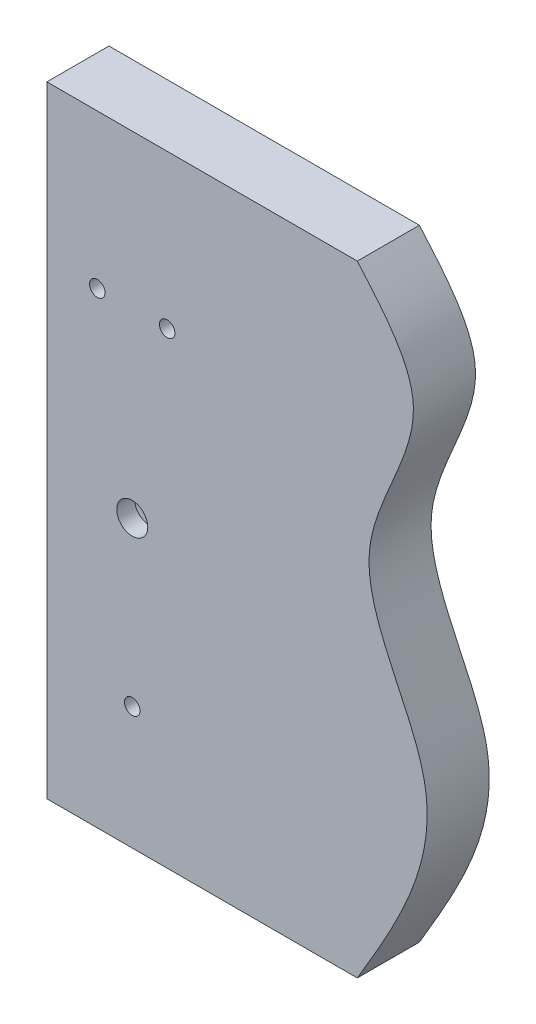
ISO-10303-21;
HEADER;
FILE_DESCRIPTION(('STEP AP214'),'2;1');
FILE_NAME('part.step','',(''),(''),'','','');
FILE_SCHEMA(('AUTOMOTIVE_DESIGN { 1 0 10303 214 1 1 1 1 }'));
ENDSEC;
DATA;
#1=APPLICATION_CONTEXT('core data for automotive mechanical design processes');
#2=APPLICATION_PROTOCOL_DEFINITION('international standard','automotive_design',2000,#1);
#3=PRODUCT_CONTEXT('',#1,'mechanical');
#4=PRODUCT('Part','Part','',(#3));
#5=PRODUCT_RELATED_PRODUCT_CATEGORY('part','',(#4));
#6=PRODUCT_DEFINITION_FORMATION('','',#4);
#7=PRODUCT_DEFINITION_CONTEXT('part definition',#1,'design');
#8=PRODUCT_DEFINITION('design','',#6,#7);
#9=PRODUCT_DEFINITION_SHAPE('','',#8);
#10=(LENGTH_UNIT() NAMED_UNIT(*) SI_UNIT(.MILLI.,.METRE.));
#11=(NAMED_UNIT(*) PLANE_ANGLE_UNIT() SI_UNIT($,.RADIAN.));
#12=(NAMED_UNIT(*) SI_UNIT($,.STERADIAN.) SOLID_ANGLE_UNIT());
#13=UNCERTAINTY_MEASURE_WITH_UNIT(LENGTH_MEASURE(1.E-05),#10,'distance_accuracy_value','');
#14=(GEOMETRIC_REPRESENTATION_CONTEXT(3) GLOBAL_UNCERTAINTY_ASSIGNED_CONTEXT((#13)) GLOBAL_UNIT_ASSIGNED_CONTEXT((#10,
#11,#12)) REPRESENTATION_CONTEXT('',''));
#15=CARTESIAN_POINT('',(0.,0.,0.));
#16=DIRECTION('',(0.,0.,1.));
#17=DIRECTION('',(1.,0.,0.));
#18=AXIS2_PLACEMENT_3D('',#15,#16,#17);
#19=CARTESIAN_POINT('',(-147.,-116.5,-8.5));
#20=DIRECTION('',(0.,-1.,0.));
#21=DIRECTION('',(1.,0.,0.));
#22=AXIS2_PLACEMENT_3D('',#19,#20,#21);
#23=PLANE('',#22);
#24=DIRECTION('',(1.,0.,0.));
#25=VECTOR('',#24,1.);
#26=CARTESIAN_POINT('',(-147.,-116.5,-8.5));
#27=LINE('',#26,#25);
#28=CARTESIAN_POINT('',(-92.8205505282296,-116.5,-8.5));
#29=VERTEX_POINT('',#28);
#30=CARTESIAN_POINT('',(-70.,-116.5,-8.5));
#31=VERTEX_POINT('',#30);
#32=EDGE_CURVE('E145',#29,#31,#27,.T.);
#33=ORIENTED_EDGE('',*,*,#32,.F.);
#34=DIRECTION('',(0.,0.,1.));
#35=VECTOR('',#34,1.);
#36=CARTESIAN_POINT('',(-92.8205505282296,-116.5,-20.));
#37=LINE('',#36,#35);
#38=CARTESIAN_POINT('',(-92.8205505282296,-116.5,8.5));
#39=VERTEX_POINT('',#38);
#40=EDGE_CURVE('E137',#29,#39,#37,.T.);
#41=ORIENTED_EDGE('',*,*,#40,.T.);
#42=DIRECTION('',(1.,0.,0.));
#43=VECTOR('',#42,1.);
#44=CARTESIAN_POINT('',(-147.,-116.5,8.5));
#45=LINE('',#44,#43);
#46=CARTESIAN_POINT('',(-70.,-116.5,8.5));
#47=VERTEX_POINT('',#46);
#48=EDGE_CURVE('E143',#39,#47,#45,.T.);
#49=ORIENTED_EDGE('',*,*,#48,.T.);
#50=DIRECTION('',(0.,0.,1.));
#51=VECTOR('',#50,1.);
#52=CARTESIAN_POINT('',(-70.,-116.5,-8.5));
#53=LINE('',#52,#51);
#54=EDGE_CURVE('E176',#31,#47,#53,.T.);
#55=ORIENTED_EDGE('',*,*,#54,.F.);
#56=EDGE_LOOP('',(#33,#41,#49,#55));
#57=FACE_BOUND('',#56,.T.);
#58=ADVANCED_FACE('F36',(#57),#23,.F.);
#59=CARTESIAN_POINT('',(-147.,-150.,-11.));
#60=DIRECTION('',(-1.,0.,0.));
#61=DIRECTION('',(0.,0.,1.));
#62=AXIS2_PLACEMENT_3D('',#59,#60,#61);
#63=PLANE('',#62);
#64=DIRECTION('',(0.,-1.,0.));
#65=VECTOR('',#64,1.);
#66=CARTESIAN_POINT('',(-147.,80.,-11.));
#67=LINE('',#66,#65);
#68=CARTESIAN_POINT('',(-147.,80.,-11.));
#69=VERTEX_POINT('',#68);
#70=CARTESIAN_POINT('',(-147.,-150.,-11.));
#71=VERTEX_POINT('',#70);
#72=EDGE_CURVE('E178',#69,#71,#67,.T.);
#73=ORIENTED_EDGE('',*,*,#72,.T.);
#74=DIRECTION('',(0.,0.,1.));
#75=VECTOR('',#74,1.);
#76=CARTESIAN_POINT('',(-147.,-150.,-11.));
#77=LINE('',#76,#75);
#78=CARTESIAN_POINT('',(-147.,-150.,11.));
#79=VERTEX_POINT('',#78);
#80=EDGE_CURVE('E181',#71,#79,#77,.T.);
#81=ORIENTED_EDGE('',*,*,#80,.T.);
#82=DIRECTION('',(0.,1.,0.));
#83=VECTOR('',#82,1.);
#84=CARTESIAN_POINT('',(-147.,80.,11.));
#85=LINE('',#84,#83);
#86=CARTESIAN_POINT('',(-147.,80.,11.));
#87=VERTEX_POINT('',#86);
#88=EDGE_CURVE('E185',#79,#87,#85,.T.);
#89=ORIENTED_EDGE('',*,*,#88,.T.);
#90=DIRECTION('',(0.,0.,-1.));
#91=VECTOR('',#90,1.);
#92=CARTESIAN_POINT('',(-147.,80.,-11.));
#93=LINE('',#92,#91);
#94=EDGE_CURVE('E188',#87,#69,#93,.T.);
#95=ORIENTED_EDGE('',*,*,#94,.T.);
#96=EDGE_LOOP('',(#73,#81,#89,#95));
#97=FACE_BOUND('',#96,.T.);
#98=DIRECTION('',(0.,0.,1.));
#99=VECTOR('',#98,1.);
#100=CARTESIAN_POINT('',(-147.,-116.5,-8.5));
#101=LINE('',#100,#99);
#102=CARTESIAN_POINT('',(-147.,-116.5,-8.5));
#103=VERTEX_POINT('',#102);
#104=CARTESIAN_POINT('',(-147.,-116.5,8.5));
#105=VERTEX_POINT('',#104);
#106=EDGE_CURVE('E168',#103,#105,#101,.T.);
#107=ORIENTED_EDGE('',*,*,#106,.F.);
#108=DIRECTION('',(0.,-1.,0.));
#109=VECTOR('',#108,1.);
#110=CARTESIAN_POINT('',(-147.,-116.5,-8.5));
#111=LINE('',#110,#109);
#112=CARTESIAN_POINT('',(-147.,46.5,-8.5));
#113=VERTEX_POINT('',#112);
#114=EDGE_CURVE('E160',#113,#103,#111,.T.);
#115=ORIENTED_EDGE('',*,*,#114,.F.);
#116=DIRECTION('',(0.,0.,1.));
#117=VECTOR('',#116,1.);
#118=CARTESIAN_POINT('',(-147.,46.5,-8.5));
#119=LINE('',#118,#117);
#120=CARTESIAN_POINT('',(-147.,46.5,8.5));
#121=VERTEX_POINT('',#120);
#122=EDGE_CURVE('E171',#113,#121,#119,.T.);
#123=ORIENTED_EDGE('',*,*,#122,.T.);
#124=DIRECTION('',(0.,-1.,0.));
#125=VECTOR('',#124,1.);
#126=CARTESIAN_POINT('',(-147.,-116.5,8.5));
#127=LINE('',#126,#125);
#128=EDGE_CURVE('E165',#121,#105,#127,.T.);
#129=ORIENTED_EDGE('',*,*,#128,.T.);
#130=EDGE_LOOP('',(#107,#115,#123,#129));
#131=FACE_BOUND('',#130,.T.);
#132=ADVANCED_FACE('F240',(#97,#131),#63,.T.);
#133=CARTESIAN_POINT('',(-150.,200.,20.));
#134=DIRECTION('',(1.,0.,0.));
#135=DIRECTION('',(0.,0.,-1.));
#136=AXIS2_PLACEMENT_3D('',#133,#134,#135);
#137=PLANE('',#136);
#138=DIRECTION('',(0.,0.,1.));
#139=VECTOR('',#138,1.);
#140=CARTESIAN_POINT('',(-150.,-150.,-11.));
#141=LINE('',#140,#139);
#142=CARTESIAN_POINT('',(-150.,-150.,-11.));
#143=VERTEX_POINT('',#142);
#144=CARTESIAN_POINT('',(-150.,-150.,11.));
#145=VERTEX_POINT('',#144);
#146=EDGE_CURVE('E193',#143,#145,#141,.T.);
#147=ORIENTED_EDGE('',*,*,#146,.F.);
#148=DIRECTION('',(0.,-1.,0.));
#149=VECTOR('',#148,1.);
#150=CARTESIAN_POINT('',(-150.,80.,-11.));
#151=LINE('',#150,#149);
#152=CARTESIAN_POINT('',(-150.,80.,-11.));
#153=VERTEX_POINT('',#152);
#154=EDGE_CURVE('E170',#153,#143,#151,.T.);
#155=ORIENTED_EDGE('',*,*,#154,.F.);
#156=DIRECTION('',(0.,0.,-1.));
#157=VECTOR('',#156,1.);
#158=CARTESIAN_POINT('',(-150.,80.,-11.));
#159=LINE('',#158,#157);
#160=CARTESIAN_POINT('',(-150.,80.,11.));
#161=VERTEX_POINT('',#160);
#162=EDGE_CURVE('E182',#161,#153,#159,.T.);
#163=ORIENTED_EDGE('',*,*,#162,.F.);
#164=DIRECTION('',(0.,1.,0.));
#165=VECTOR('',#164,1.);
#166=CARTESIAN_POINT('',(-150.,80.,11.));
#167=LINE('',#166,#165);
#168=EDGE_CURVE('E196',#145,#161,#167,.T.);
#169=ORIENTED_EDGE('',*,*,#168,.F.);
#170=EDGE_LOOP('',(#147,#155,#163,#169));
#171=FACE_BOUND('',#170,.T.);
#172=DIRECTION('',(0.,-1.,0.));
#173=VECTOR('',#172,1.);
#174=CARTESIAN_POINT('',(-150.,200.,-20.));
#175=LINE('',#174,#173);
#176=CARTESIAN_POINT('',(-150.,200.,-20.));
#177=VERTEX_POINT('',#176);
#178=CARTESIAN_POINT('',(-150.,-200.,-20.));
#179=VERTEX_POINT('',#178);
#180=EDGE_CURVE('E204',#177,#179,#175,.T.);
#181=ORIENTED_EDGE('',*,*,#180,.T.);
#182=DIRECTION('',(0.,0.,-1.));
#183=VECTOR('',#182,1.);
#184=CARTESIAN_POINT('',(-150.,-200.,20.));
#185=LINE('',#184,#183);
#186=CARTESIAN_POINT('',(-150.,-200.,20.));
#187=VERTEX_POINT('',#186);
#188=EDGE_CURVE('E44',#187,#179,#185,.T.);
#189=ORIENTED_EDGE('',*,*,#188,.F.);
#190=DIRECTION('',(0.,-1.,0.));
#191=VECTOR('',#190,1.);
#192=CARTESIAN_POINT('',(-150.,200.,20.));
#193=LINE('',#192,#191);
#194=CARTESIAN_POINT('',(-150.,200.,20.));
#195=VERTEX_POINT('',#194);
#196=EDGE_CURVE('E211',#195,#187,#193,.T.);
#197=ORIENTED_EDGE('',*,*,#196,.F.);
#198=DIRECTION('',(0.,0.,-1.));
#199=VECTOR('',#198,1.);
#200=CARTESIAN_POINT('',(-150.,200.,20.));
#201=LINE('',#200,#199);
#202=EDGE_CURVE('E532',#195,#177,#201,.T.);
#203=ORIENTED_EDGE('',*,*,#202,.T.);
#204=EDGE_LOOP('',(#181,#189,#197,#203));
#205=FACE_BOUND('',#204,.T.);
#206=ADVANCED_FACE('F38',(#171,#205),#137,.F.);
#207=CARTESIAN_POINT('',(-150.,-200.,20.));
#208=DIRECTION('',(0.,1.,0.));
#209=DIRECTION('',(0.,0.,1.));
#210=AXIS2_PLACEMENT_3D('',#207,#208,#209);
#211=PLANE('',#210);
#212=DIRECTION('',(1.,0.,0.));
#213=VECTOR('',#212,1.);
#214=CARTESIAN_POINT('',(-150.,-200.,-20.));
#215=LINE('',#214,#213);
#216=CARTESIAN_POINT('',(50.,-200.,-20.));
#217=VERTEX_POINT('',#216);
#218=EDGE_CURVE('E539',#179,#217,#215,.T.);
#219=ORIENTED_EDGE('',*,*,#218,.T.);
#220=DIRECTION('',(0.,0.,-1.));
#221=VECTOR('',#220,1.);
#222=CARTESIAN_POINT('',(50.,-200.,20.));
#223=LINE('',#222,#221);
#224=CARTESIAN_POINT('',(50.,-200.,20.));
#225=VERTEX_POINT('',#224);
#226=EDGE_CURVE('E338',#225,#217,#223,.T.);
#227=ORIENTED_EDGE('',*,*,#226,.F.);
#228=DIRECTION('',(1.,0.,0.));
#229=VECTOR('',#228,1.);
#230=CARTESIAN_POINT('',(-150.,-200.,20.));
#231=LINE('',#230,#229);
#232=EDGE_CURVE('E214',#187,#225,#231,.T.);
#233=ORIENTED_EDGE('',*,*,#232,.F.);
#234=ORIENTED_EDGE('',*,*,#188,.T.);
#235=EDGE_LOOP('',(#219,#227,#233,#234));
#236=FACE_BOUND('',#235,.T.);
#237=ADVANCED_FACE('F232',(#236),#211,.F.);
#238=CARTESIAN_POINT('',(50.,-200.,20.));
#239=CARTESIAN_POINT('',(75.8926121429316,-156.299492504264,20.));
#240=CARTESIAN_POINT('',(123.473848535243,-75.9937988901806,20.));
#241=CARTESIAN_POINT('',(27.2782564010871,35.2365570661427,20.));
#242=CARTESIAN_POINT('',(108.79400955081,132.296562906832,20.));
#243=CARTESIAN_POINT('',(66.8795606617927,180.562572919298,20.));
#244=CARTESIAN_POINT('',(50.,200.,20.));
#245=B_SPLINE_CURVE_WITH_KNOTS('',3,(#238,#239,#240,#241,#242,#243,#244),.UNSPECIFIED.,.F.,.F.,
(4,1,1,1,4),(0.,0.322833315670229,0.593250623900925,0.836196086314051,1.),.UNSPECIFIED.);
#246=DIRECTION('',(0.,0.,-1.));
#247=VECTOR('',#246,1.);
#248=SURFACE_OF_LINEAR_EXTRUSION('',#245,#247);
#249=CARTESIAN_POINT('',(50.,-200.,-20.));
#250=CARTESIAN_POINT('',(75.8926121429316,-156.299492504264,-20.));
#251=CARTESIAN_POINT('',(123.473848535243,-75.9937988901806,-20.));
#252=CARTESIAN_POINT('',(27.2782564010871,35.2365570661427,-20.));
#253=CARTESIAN_POINT('',(108.79400955081,132.296562906832,-20.));
#254=CARTESIAN_POINT('',(66.8795606617927,180.562572919298,-20.));
#255=CARTESIAN_POINT('',(50.,200.,-20.));
#256=B_SPLINE_CURVE_WITH_KNOTS('',3,(#249,#250,#251,#252,#253,#254,#255),.UNSPECIFIED.,.F.,.F.,
(4,1,1,1,4),(0.,0.322833315670229,0.593250623900925,0.836196086314051,1.),.UNSPECIFIED.);
#257=CARTESIAN_POINT('',(50.,200.,-20.));
#258=VERTEX_POINT('',#257);
#259=EDGE_CURVE('E536',#217,#258,#256,.T.);
#260=ORIENTED_EDGE('',*,*,#259,.T.);
#261=DIRECTION('',(0.,0.,-1.));
#262=VECTOR('',#261,1.);
#263=CARTESIAN_POINT('',(50.,200.,20.));
#264=LINE('',#263,#262);
#265=CARTESIAN_POINT('',(50.,200.,20.));
#266=VERTEX_POINT('',#265);
#267=EDGE_CURVE('E341',#266,#258,#264,.T.);
#268=ORIENTED_EDGE('',*,*,#267,.F.);
#269=EDGE_CURVE('E217',#225,#266,#245,.T.);
#270=ORIENTED_EDGE('',*,*,#269,.F.);
#271=ORIENTED_EDGE('',*,*,#226,.T.);
#272=EDGE_LOOP('',(#260,#268,#270,#271));
#273=FACE_BOUND('',#272,.T.);
#274=ADVANCED_FACE('F228',(#273),#248,.F.);
#275=CARTESIAN_POINT('',(-150.,200.,20.));
#276=DIRECTION('',(0.,-1.,0.));
#277=DIRECTION('',(0.,0.,-1.));
#278=AXIS2_PLACEMENT_3D('',#275,#276,#277);
#279=PLANE('',#278);
#280=DIRECTION('',(-1.,0.,0.));
#281=VECTOR('',#280,1.);
#282=CARTESIAN_POINT('',(-150.,200.,-20.));
#283=LINE('',#282,#281);
#284=EDGE_CURVE('E215',#258,#177,#283,.T.);
#285=ORIENTED_EDGE('',*,*,#284,.T.);
#286=ORIENTED_EDGE('',*,*,#202,.F.);
#287=DIRECTION('',(-1.,0.,0.));
#288=VECTOR('',#287,1.);
#289=CARTESIAN_POINT('',(-150.,200.,20.));
#290=LINE('',#289,#288);
#291=EDGE_CURVE('E222',#266,#195,#290,.T.);
#292=ORIENTED_EDGE('',*,*,#291,.F.);
#293=ORIENTED_EDGE('',*,*,#267,.T.);
#294=EDGE_LOOP('',(#285,#286,#292,#293));
#295=FACE_BOUND('',#294,.T.);
#296=ADVANCED_FACE('F231',(#295),#279,.F.);
#297=CARTESIAN_POINT('',(64.7438582512238,2.07966306238669,20.));
#298=DIRECTION('',(0.,0.,1.));
#299=DIRECTION('',(1.,0.,0.));
#300=AXIS2_PLACEMENT_3D('',#297,#298,#299);
#301=PLANE('',#300);
#302=CARTESIAN_POINT('',(-72.5,101.,20.));
#303=DIRECTION('',(0.,0.,1.));
#304=DIRECTION('',(1.,0.,0.));
#305=AXIS2_PLACEMENT_3D('',#302,#303,#304);
#306=CIRCLE('',#305,5.00000000000001);
#307=CARTESIAN_POINT('',(-67.5,101.,20.));
#308=VERTEX_POINT('',#307);
#309=EDGE_CURVE('E303',#308,#308,#306,.T.);
#310=ORIENTED_EDGE('',*,*,#309,.F.);
#311=EDGE_LOOP('',(#310));
#312=FACE_BOUND('',#311,.T.);
#313=CARTESIAN_POINT('',(-95.,-121.,20.));
#314=DIRECTION('',(0.,0.,1.));
#315=DIRECTION('',(1.,0.,0.));
#316=AXIS2_PLACEMENT_3D('',#313,#314,#315);
#317=CIRCLE('',#316,5.00000000000001);
#318=CARTESIAN_POINT('',(-90.,-121.,20.));
#319=VERTEX_POINT('',#318);
#320=EDGE_CURVE('E297',#319,#319,#317,.T.);
#321=ORIENTED_EDGE('',*,*,#320,.F.);
#322=EDGE_LOOP('',(#321));
#323=FACE_BOUND('',#322,.T.);
#324=CARTESIAN_POINT('',(-117.5,101.,20.));
#325=DIRECTION('',(0.,0.,1.));
#326=DIRECTION('',(1.,0.,0.));
#327=AXIS2_PLACEMENT_3D('',#324,#325,#326);
#328=CIRCLE('',#327,5.00000000000001);
#329=CARTESIAN_POINT('',(-112.5,101.,20.));
#330=VERTEX_POINT('',#329);
#331=EDGE_CURVE('E289',#330,#330,#328,.T.);
#332=ORIENTED_EDGE('',*,*,#331,.F.);
#333=EDGE_LOOP('',(#332));
#334=FACE_BOUND('',#333,.T.);
#335=CARTESIAN_POINT('',(-95.,-16.,20.));
#336=DIRECTION('',(0.,0.,1.));
#337=DIRECTION('',(1.,0.,0.));
#338=AXIS2_PLACEMENT_3D('',#335,#336,#337);
#339=CIRCLE('',#338,9.99999999999999);
#340=CARTESIAN_POINT('',(-85.,-16.,20.));
#341=VERTEX_POINT('',#340);
#342=EDGE_CURVE('E282',#341,#341,#339,.T.);
#343=ORIENTED_EDGE('',*,*,#342,.F.);
#344=EDGE_LOOP('',(#343));
#345=FACE_BOUND('',#344,.T.);
#346=ORIENTED_EDGE('',*,*,#196,.T.);
#347=ORIENTED_EDGE('',*,*,#232,.T.);
#348=ORIENTED_EDGE('',*,*,#269,.T.);
#349=ORIENTED_EDGE('',*,*,#291,.T.);
#350=EDGE_LOOP('',(#346,#347,#348,#349));
#351=FACE_BOUND('',#350,.T.);
#352=ADVANCED_FACE('F318',(#312,#323,#334,#345,#351),#301,.T.);
#353=CARTESIAN_POINT('',(64.7438582512238,2.07966306238669,-20.));
#354=DIRECTION('',(0.,0.,1.));
#355=DIRECTION('',(1.,0.,0.));
#356=AXIS2_PLACEMENT_3D('',#353,#354,#355);
#357=PLANE('',#356);
#358=CARTESIAN_POINT('',(-72.5,101.,-20.));
#359=DIRECTION('',(0.,0.,1.));
#360=DIRECTION('',(1.,0.,0.));
#361=AXIS2_PLACEMENT_3D('',#358,#359,#360);
#362=CIRCLE('',#361,5.00000000000001);
#363=CARTESIAN_POINT('',(-67.5,101.,-20.));
#364=VERTEX_POINT('',#363);
#365=EDGE_CURVE('E300',#364,#364,#362,.T.);
#366=ORIENTED_EDGE('',*,*,#365,.T.);
#367=EDGE_LOOP('',(#366));
#368=FACE_BOUND('',#367,.T.);
#369=CARTESIAN_POINT('',(-95.,-121.,-20.));
#370=DIRECTION('',(0.,0.,1.));
#371=DIRECTION('',(1.,0.,0.));
#372=AXIS2_PLACEMENT_3D('',#369,#370,#371);
#373=CIRCLE('',#372,5.00000000000001);
#374=CARTESIAN_POINT('',(-90.,-121.,-20.));
#375=VERTEX_POINT('',#374);
#376=EDGE_CURVE('E296',#375,#375,#373,.T.);
#377=ORIENTED_EDGE('',*,*,#376,.T.);
#378=EDGE_LOOP('',(#377));
#379=FACE_BOUND('',#378,.T.);
#380=CARTESIAN_POINT('',(-117.5,101.,-20.));
#381=DIRECTION('',(0.,0.,1.));
#382=DIRECTION('',(1.,0.,0.));
#383=AXIS2_PLACEMENT_3D('',#380,#381,#382);
#384=CIRCLE('',#383,5.00000000000001);
#385=CARTESIAN_POINT('',(-112.5,101.,-20.));
#386=VERTEX_POINT('',#385);
#387=EDGE_CURVE('E286',#386,#386,#384,.T.);
#388=ORIENTED_EDGE('',*,*,#387,.T.);
#389=EDGE_LOOP('',(#388));
#390=FACE_BOUND('',#389,.T.);
#391=CARTESIAN_POINT('',(-95.,-16.,-20.));
#392=DIRECTION('',(0.,0.,1.));
#393=DIRECTION('',(1.,0.,0.));
#394=AXIS2_PLACEMENT_3D('',#391,#392,#393);
#395=CIRCLE('',#394,9.99999999999999);
#396=CARTESIAN_POINT('',(-85.,-16.,-20.));
#397=VERTEX_POINT('',#396);
#398=EDGE_CURVE('E285',#397,#397,#395,.T.);
#399=ORIENTED_EDGE('',*,*,#398,.T.);
#400=EDGE_LOOP('',(#399));
#401=FACE_BOUND('',#400,.T.);
#402=ORIENTED_EDGE('',*,*,#180,.F.);
#403=ORIENTED_EDGE('',*,*,#284,.F.);
#404=ORIENTED_EDGE('',*,*,#259,.F.);
#405=ORIENTED_EDGE('',*,*,#218,.F.);
#406=EDGE_LOOP('',(#402,#403,#404,#405));
#407=FACE_BOUND('',#406,.T.);
#408=ADVANCED_FACE('F309',(#368,#379,#390,#401,#407),#357,.F.);
#409=CARTESIAN_POINT('',(-147.,80.,-11.));
#410=DIRECTION('',(0.,0.,-1.));
#411=DIRECTION('',(0.,1.,0.));
#412=AXIS2_PLACEMENT_3D('',#409,#410,#411);
#413=PLANE('',#412);
#414=ORIENTED_EDGE('',*,*,#154,.T.);
#415=DIRECTION('',(-1.,0.,0.));
#416=VECTOR('',#415,1.);
#417=CARTESIAN_POINT('',(-147.,-150.,-11.));
#418=LINE('',#417,#416);
#419=EDGE_CURVE('E191',#71,#143,#418,.T.);
#420=ORIENTED_EDGE('',*,*,#419,.F.);
#421=ORIENTED_EDGE('',*,*,#72,.F.);
#422=DIRECTION('',(-1.,0.,0.));
#423=VECTOR('',#422,1.);
#424=CARTESIAN_POINT('',(-147.,80.,-11.));
#425=LINE('',#424,#423);
#426=EDGE_CURVE('E202',#69,#153,#425,.T.);
#427=ORIENTED_EDGE('',*,*,#426,.T.);
#428=EDGE_LOOP('',(#414,#420,#421,#427));
#429=FACE_BOUND('',#428,.T.);
#430=ADVANCED_FACE('F433',(#429),#413,.F.);
#431=CARTESIAN_POINT('',(-147.,80.,-11.));
#432=DIRECTION('',(0.,1.,0.));
#433=DIRECTION('',(-1.,0.,0.));
#434=AXIS2_PLACEMENT_3D('',#431,#432,#433);
#435=PLANE('',#434);
#436=ORIENTED_EDGE('',*,*,#162,.T.);
#437=ORIENTED_EDGE('',*,*,#426,.F.);
#438=ORIENTED_EDGE('',*,*,#94,.F.);
#439=DIRECTION('',(-1.,0.,0.));
#440=VECTOR('',#439,1.);
#441=CARTESIAN_POINT('',(-147.,80.,11.));
#442=LINE('',#441,#440);
#443=EDGE_CURVE('E205',#87,#161,#442,.T.);
#444=ORIENTED_EDGE('',*,*,#443,.T.);
#445=EDGE_LOOP('',(#436,#437,#438,#444));
#446=FACE_BOUND('',#445,.T.);
#447=ADVANCED_FACE('F429',(#446),#435,.F.);
#448=CARTESIAN_POINT('',(-147.,80.,11.));
#449=DIRECTION('',(0.,0.,1.));
#450=DIRECTION('',(0.,-1.,0.));
#451=AXIS2_PLACEMENT_3D('',#448,#449,#450);
#452=PLANE('',#451);
#453=ORIENTED_EDGE('',*,*,#168,.T.);
#454=ORIENTED_EDGE('',*,*,#443,.F.);
#455=ORIENTED_EDGE('',*,*,#88,.F.);
#456=DIRECTION('',(-1.,0.,0.));
#457=VECTOR('',#456,1.);
#458=CARTESIAN_POINT('',(-147.,-150.,11.));
#459=LINE('',#458,#457);
#460=EDGE_CURVE('E207',#79,#145,#459,.T.);
#461=ORIENTED_EDGE('',*,*,#460,.T.);
#462=EDGE_LOOP('',(#453,#454,#455,#461));
#463=FACE_BOUND('',#462,.T.);
#464=ADVANCED_FACE('F262',(#463),#452,.F.);
#465=CARTESIAN_POINT('',(-147.,-150.,-11.));
#466=DIRECTION('',(0.,-1.,0.));
#467=DIRECTION('',(1.,0.,0.));
#468=AXIS2_PLACEMENT_3D('',#465,#466,#467);
#469=PLANE('',#468);
#470=ORIENTED_EDGE('',*,*,#146,.T.);
#471=ORIENTED_EDGE('',*,*,#460,.F.);
#472=ORIENTED_EDGE('',*,*,#80,.F.);
#473=ORIENTED_EDGE('',*,*,#419,.T.);
#474=EDGE_LOOP('',(#470,#471,#472,#473));
#475=FACE_BOUND('',#474,.T.);
#476=ADVANCED_FACE('F253',(#475),#469,.F.);
#477=CARTESIAN_POINT('',(-97.1794494717704,-116.5,8.5));
#478=VERTEX_POINT('',#477);
#479=EDGE_CURVE('E57',#105,#478,#45,.T.);
#480=ORIENTED_EDGE('',*,*,#479,.T.);
#481=DIRECTION('',(0.,0.,1.));
#482=VECTOR('',#481,1.);
#483=CARTESIAN_POINT('',(-97.1794494717704,-116.5,-20.));
#484=LINE('',#483,#482);
#485=CARTESIAN_POINT('',(-97.1794494717704,-116.5,-8.5));
#486=VERTEX_POINT('',#485);
#487=EDGE_CURVE('E51',#478,#486,#484,.F.);
#488=ORIENTED_EDGE('',*,*,#487,.T.);
#489=EDGE_CURVE('E267',#103,#486,#27,.T.);
#490=ORIENTED_EDGE('',*,*,#489,.F.);
#491=ORIENTED_EDGE('',*,*,#106,.T.);
#492=EDGE_LOOP('',(#480,#488,#490,#491));
#493=FACE_BOUND('',#492,.T.);
#494=ADVANCED_FACE('F244',(#493),#23,.F.);
#495=CARTESIAN_POINT('',(-147.,46.5,-8.5));
#496=DIRECTION('',(0.,1.,0.));
#497=DIRECTION('',(-1.,0.,0.));
#498=AXIS2_PLACEMENT_3D('',#495,#496,#497);
#499=PLANE('',#498);
#500=DIRECTION('',(-1.,0.,0.));
#501=VECTOR('',#500,1.);
#502=CARTESIAN_POINT('',(-147.,46.5,8.5));
#503=LINE('',#502,#501);
#504=CARTESIAN_POINT('',(-70.,46.5,8.5));
#505=VERTEX_POINT('',#504);
#506=EDGE_CURVE('E163',#505,#121,#503,.T.);
#507=ORIENTED_EDGE('',*,*,#506,.T.);
#508=ORIENTED_EDGE('',*,*,#122,.F.);
#509=DIRECTION('',(-1.,0.,0.));
#510=VECTOR('',#509,1.);
#511=CARTESIAN_POINT('',(-147.,46.5,-8.5));
#512=LINE('',#511,#510);
#513=CARTESIAN_POINT('',(-70.,46.5,-8.5));
#514=VERTEX_POINT('',#513);
#515=EDGE_CURVE('E278',#514,#113,#512,.T.);
#516=ORIENTED_EDGE('',*,*,#515,.F.);
#517=DIRECTION('',(0.,0.,1.));
#518=VECTOR('',#517,1.);
#519=CARTESIAN_POINT('',(-70.,46.5,-8.5));
#520=LINE('',#519,#518);
#521=EDGE_CURVE('E174',#514,#505,#520,.T.);
#522=ORIENTED_EDGE('',*,*,#521,.T.);
#523=EDGE_LOOP('',(#507,#508,#516,#522));
#524=FACE_BOUND('',#523,.T.);
#525=ADVANCED_FACE('F252',(#524),#499,.F.);
#526=CARTESIAN_POINT('',(-70.,-116.5,-8.5));
#527=DIRECTION('',(1.,0.,0.));
#528=DIRECTION('',(0.,0.,-1.));
#529=AXIS2_PLACEMENT_3D('',#526,#527,#528);
#530=PLANE('',#529);
#531=DIRECTION('',(0.,1.,0.));
#532=VECTOR('',#531,1.);
#533=CARTESIAN_POINT('',(-70.,-116.5,8.5));
#534=LINE('',#533,#532);
#535=EDGE_CURVE('E152',#47,#505,#534,.T.);
#536=ORIENTED_EDGE('',*,*,#535,.T.);
#537=ORIENTED_EDGE('',*,*,#521,.F.);
#538=DIRECTION('',(0.,1.,0.));
#539=VECTOR('',#538,1.);
#540=CARTESIAN_POINT('',(-70.,-116.5,-8.5));
#541=LINE('',#540,#539);
#542=EDGE_CURVE('E275',#31,#514,#541,.T.);
#543=ORIENTED_EDGE('',*,*,#542,.F.);
#544=ORIENTED_EDGE('',*,*,#54,.T.);
#545=EDGE_LOOP('',(#536,#537,#543,#544));
#546=FACE_BOUND('',#545,.T.);
#547=ADVANCED_FACE('F259',(#546),#530,.F.);
#548=CARTESIAN_POINT('',(-70.,-116.5,-8.5));
#549=DIRECTION('',(0.,0.,1.));
#550=DIRECTION('',(1.,0.,0.));
#551=AXIS2_PLACEMENT_3D('',#548,#549,#550);
#552=PLANE('',#551);
#553=CARTESIAN_POINT('',(-95.,-121.,-8.5));
#554=DIRECTION('',(0.,0.,1.));
#555=DIRECTION('',(1.,0.,0.));
#556=AXIS2_PLACEMENT_3D('',#553,#554,#555);
#557=CIRCLE('',#556,5.00000000000001);
#558=EDGE_CURVE('E146',#29,#486,#557,.T.);
#559=ORIENTED_EDGE('',*,*,#558,.F.);
#560=ORIENTED_EDGE('',*,*,#32,.T.);
#561=ORIENTED_EDGE('',*,*,#542,.T.);
#562=ORIENTED_EDGE('',*,*,#515,.T.);
#563=ORIENTED_EDGE('',*,*,#114,.T.);
#564=ORIENTED_EDGE('',*,*,#489,.T.);
#565=EDGE_LOOP('',(#559,#560,#561,#562,#563,#564));
#566=FACE_BOUND('',#565,.T.);
#567=CARTESIAN_POINT('',(-95.,-16.,-8.5));
#568=DIRECTION('',(0.,0.,1.));
#569=DIRECTION('',(1.,0.,0.));
#570=AXIS2_PLACEMENT_3D('',#567,#568,#569);
#571=CIRCLE('',#570,9.99999999999999);
#572=CARTESIAN_POINT('',(-85.,-16.,-8.5));
#573=VERTEX_POINT('',#572);
#574=EDGE_CURVE('E153',#573,#573,#571,.T.);
#575=ORIENTED_EDGE('',*,*,#574,.F.);
#576=EDGE_LOOP('',(#575));
#577=FACE_BOUND('',#576,.T.);
#578=ADVANCED_FACE('F359',(#566,#577),#552,.T.);
#579=CARTESIAN_POINT('',(-70.,-116.5,8.5));
#580=DIRECTION('',(0.,0.,1.));
#581=DIRECTION('',(1.,0.,0.));
#582=AXIS2_PLACEMENT_3D('',#579,#580,#581);
#583=PLANE('',#582);
#584=CARTESIAN_POINT('',(-95.,-16.,8.5));
#585=DIRECTION('',(0.,0.,1.));
#586=DIRECTION('',(1.,0.,0.));
#587=AXIS2_PLACEMENT_3D('',#584,#585,#586);
#588=CIRCLE('',#587,9.99999999999999);
#589=CARTESIAN_POINT('',(-85.,-16.,8.5));
#590=VERTEX_POINT('',#589);
#591=EDGE_CURVE('E156',#590,#590,#588,.T.);
#592=ORIENTED_EDGE('',*,*,#591,.T.);
#593=EDGE_LOOP('',(#592));
#594=FACE_BOUND('',#593,.T.);
#595=ORIENTED_EDGE('',*,*,#48,.F.);
#596=CARTESIAN_POINT('',(-95.,-121.,8.5));
#597=DIRECTION('',(0.,0.,1.));
#598=DIRECTION('',(1.,0.,0.));
#599=AXIS2_PLACEMENT_3D('',#596,#597,#598);
#600=CIRCLE('',#599,5.00000000000001);
#601=EDGE_CURVE('E11',#39,#478,#600,.T.);
#602=ORIENTED_EDGE('',*,*,#601,.T.);
#603=ORIENTED_EDGE('',*,*,#479,.F.);
#604=ORIENTED_EDGE('',*,*,#128,.F.);
#605=ORIENTED_EDGE('',*,*,#506,.F.);
#606=ORIENTED_EDGE('',*,*,#535,.F.);
#607=EDGE_LOOP('',(#595,#602,#603,#604,#605,#606));
#608=FACE_BOUND('',#607,.T.);
#609=ADVANCED_FACE('F149',(#594,#608),#583,.F.);
#610=CARTESIAN_POINT('',(-95.,-16.,-20.));
#611=DIRECTION('',(0.,0.,1.));
#612=DIRECTION('',(1.,0.,0.));
#613=AXIS2_PLACEMENT_3D('',#610,#611,#612);
#614=CYLINDRICAL_SURFACE('',#613,9.99999999999999);
#615=ORIENTED_EDGE('',*,*,#342,.T.);
#616=EDGE_LOOP('',(#615));
#617=FACE_BOUND('',#616,.T.);
#618=ORIENTED_EDGE('',*,*,#591,.F.);
#619=EDGE_LOOP('',(#618));
#620=FACE_BOUND('',#619,.T.);
#621=ADVANCED_FACE('F348',(#617,#620),#614,.F.);
#622=ORIENTED_EDGE('',*,*,#574,.T.);
#623=EDGE_LOOP('',(#622));
#624=FACE_BOUND('',#623,.T.);
#625=ORIENTED_EDGE('',*,*,#398,.F.);
#626=EDGE_LOOP('',(#625));
#627=FACE_BOUND('',#626,.T.);
#628=ADVANCED_FACE('F350',(#624,#627),#614,.F.);
#629=CARTESIAN_POINT('',(-117.5,101.,-20.));
#630=DIRECTION('',(0.,0.,1.));
#631=DIRECTION('',(1.,0.,0.));
#632=AXIS2_PLACEMENT_3D('',#629,#630,#631);
#633=CYLINDRICAL_SURFACE('',#632,5.00000000000001);
#634=ORIENTED_EDGE('',*,*,#387,.F.);
#635=EDGE_LOOP('',(#634));
#636=FACE_BOUND('',#635,.T.);
#637=ORIENTED_EDGE('',*,*,#331,.T.);
#638=EDGE_LOOP('',(#637));
#639=FACE_BOUND('',#638,.T.);
#640=ADVANCED_FACE('F357',(#636,#639),#633,.F.);
#641=CARTESIAN_POINT('',(-95.,-121.,-20.));
#642=DIRECTION('',(0.,0.,1.));
#643=DIRECTION('',(1.,0.,0.));
#644=AXIS2_PLACEMENT_3D('',#641,#642,#643);
#645=CYLINDRICAL_SURFACE('',#644,5.00000000000001);
#646=ORIENTED_EDGE('',*,*,#558,.T.);
#647=ORIENTED_EDGE('',*,*,#487,.F.);
#648=ORIENTED_EDGE('',*,*,#601,.F.);
#649=ORIENTED_EDGE('',*,*,#40,.F.);
#650=EDGE_LOOP('',(#646,#647,#648,#649));
#651=FACE_BOUND('',#650,.T.);
#652=ORIENTED_EDGE('',*,*,#376,.F.);
#653=EDGE_LOOP('',(#652));
#654=FACE_BOUND('',#653,.T.);
#655=ORIENTED_EDGE('',*,*,#320,.T.);
#656=EDGE_LOOP('',(#655));
#657=FACE_BOUND('',#656,.T.);
#658=ADVANCED_FACE('F135',(#651,#654,#657),#645,.F.);
#659=CARTESIAN_POINT('',(-72.5,101.,-20.));
#660=DIRECTION('',(0.,0.,1.));
#661=DIRECTION('',(1.,0.,0.));
#662=AXIS2_PLACEMENT_3D('',#659,#660,#661);
#663=CYLINDRICAL_SURFACE('',#662,5.00000000000001);
#664=ORIENTED_EDGE('',*,*,#365,.F.);
#665=EDGE_LOOP('',(#664));
#666=FACE_BOUND('',#665,.T.);
#667=ORIENTED_EDGE('',*,*,#309,.T.);
#668=EDGE_LOOP('',(#667));
#669=FACE_BOUND('',#668,.T.);
#670=ADVANCED_FACE('F312',(#666,#669),#663,.F.);
#671=CLOSED_SHELL('',(#58,#132,#206,#237,#274,#296,#352,#408,#430,#447,#464,#476,#494,#525,#547,
#578,#609,#621,#628,#640,#658,#670));
#672=MANIFOLD_SOLID_BREP('B2',#671);
#673=ADVANCED_BREP_SHAPE_REPRESENTATION('',(#18,#672),#14);
#674=SHAPE_DEFINITION_REPRESENTATION(#9,#673);
ENDSEC;
END-ISO-10303-21;
